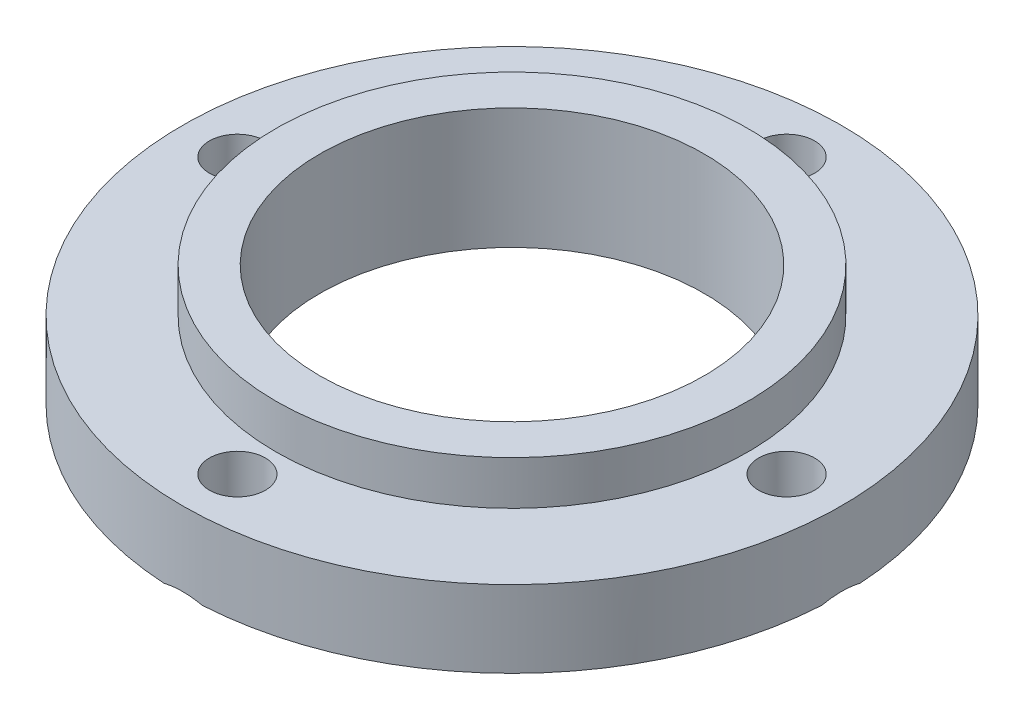
ISO-10303-21;
HEADER;
FILE_DESCRIPTION(('STEP AP214'),'2;1');
FILE_NAME('part.step','',(''),(''),'','','');
FILE_SCHEMA(('AUTOMOTIVE_DESIGN { 1 0 10303 214 1 1 1 1 }'));
ENDSEC;
DATA;
#1=APPLICATION_CONTEXT('core data for automotive mechanical design processes');
#2=APPLICATION_PROTOCOL_DEFINITION('international standard','automotive_design',2000,#1);
#3=PRODUCT_CONTEXT('',#1,'mechanical');
#4=PRODUCT('Part','Part','',(#3));
#5=PRODUCT_RELATED_PRODUCT_CATEGORY('part','',(#4));
#6=PRODUCT_DEFINITION_FORMATION('','',#4);
#7=PRODUCT_DEFINITION_CONTEXT('part definition',#1,'design');
#8=PRODUCT_DEFINITION('design','',#6,#7);
#9=PRODUCT_DEFINITION_SHAPE('','',#8);
#10=(LENGTH_UNIT() NAMED_UNIT(*) SI_UNIT(.MILLI.,.METRE.));
#11=(NAMED_UNIT(*) PLANE_ANGLE_UNIT() SI_UNIT($,.RADIAN.));
#12=(NAMED_UNIT(*) SI_UNIT($,.STERADIAN.) SOLID_ANGLE_UNIT());
#13=UNCERTAINTY_MEASURE_WITH_UNIT(LENGTH_MEASURE(1.E-05),#10,'distance_accuracy_value','');
#14=(GEOMETRIC_REPRESENTATION_CONTEXT(3) GLOBAL_UNCERTAINTY_ASSIGNED_CONTEXT((#13)) GLOBAL_UNIT_ASSIGNED_CONTEXT((#10,
#11,#12)) REPRESENTATION_CONTEXT('',''));
#15=CARTESIAN_POINT('',(0.,0.,0.));
#16=DIRECTION('',(0.,0.,1.));
#17=DIRECTION('',(1.,0.,0.));
#18=AXIS2_PLACEMENT_3D('',#15,#16,#17);
#19=CARTESIAN_POINT('',(0.,7.,0.));
#20=DIRECTION('',(0.,1.,0.));
#21=DIRECTION('',(0.,0.,1.));
#22=AXIS2_PLACEMENT_3D('',#19,#20,#21);
#23=PLANE('',#22);
#24=CARTESIAN_POINT('',(2.61861252083204E-13,7.,25.));
#25=DIRECTION('',(0.,1.,0.));
#26=DIRECTION('',(0.,0.,1.));
#27=AXIS2_PLACEMENT_3D('',#24,#25,#26);
#28=CIRCLE('',#27,2.55);
#29=CARTESIAN_POINT('',(2.61861252083204E-13,7.,27.55));
#30=VERTEX_POINT('',#29);
#31=EDGE_CURVE('E186',#30,#30,#28,.T.);
#32=ORIENTED_EDGE('',*,*,#31,.F.);
#33=EDGE_LOOP('',(#32));
#34=FACE_BOUND('',#33,.T.);
#35=CARTESIAN_POINT('',(-25.,7.,0.));
#36=DIRECTION('',(0.,1.,0.));
#37=DIRECTION('',(0.,0.,1.));
#38=AXIS2_PLACEMENT_3D('',#35,#36,#37);
#39=CIRCLE('',#38,2.55);
#40=CARTESIAN_POINT('',(-25.,7.,2.55));
#41=VERTEX_POINT('',#40);
#42=EDGE_CURVE('E184',#41,#41,#39,.T.);
#43=ORIENTED_EDGE('',*,*,#42,.F.);
#44=EDGE_LOOP('',(#43));
#45=FACE_BOUND('',#44,.T.);
#46=CARTESIAN_POINT('',(0.,7.,-25.));
#47=DIRECTION('',(0.,1.,0.));
#48=DIRECTION('',(0.,0.,1.));
#49=AXIS2_PLACEMENT_3D('',#46,#47,#48);
#50=CIRCLE('',#49,2.55);
#51=CARTESIAN_POINT('',(0.,7.,-22.45));
#52=VERTEX_POINT('',#51);
#53=EDGE_CURVE('E185',#52,#52,#50,.T.);
#54=ORIENTED_EDGE('',*,*,#53,.F.);
#55=EDGE_LOOP('',(#54));
#56=FACE_BOUND('',#55,.T.);
#57=CARTESIAN_POINT('',(25.,7.,0.));
#58=DIRECTION('',(0.,1.,0.));
#59=DIRECTION('',(0.,0.,1.));
#60=AXIS2_PLACEMENT_3D('',#57,#58,#59);
#61=CIRCLE('',#60,2.55);
#62=CARTESIAN_POINT('',(25.,7.,2.55));
#63=VERTEX_POINT('',#62);
#64=EDGE_CURVE('E189',#63,#63,#61,.T.);
#65=ORIENTED_EDGE('',*,*,#64,.F.);
#66=EDGE_LOOP('',(#65));
#67=FACE_BOUND('',#66,.T.);
#68=CARTESIAN_POINT('',(0.,7.,0.));
#69=DIRECTION('',(0.,1.,0.));
#70=DIRECTION('',(0.,0.,1.));
#71=AXIS2_PLACEMENT_3D('',#68,#69,#70);
#72=CIRCLE('',#71,30.);
#73=CARTESIAN_POINT('',(0.,7.,30.));
#74=VERTEX_POINT('',#73);
#75=EDGE_CURVE('E97',#74,#74,#72,.T.);
#76=ORIENTED_EDGE('',*,*,#75,.T.);
#77=EDGE_LOOP('',(#76));
#78=FACE_BOUND('',#77,.T.);
#79=CARTESIAN_POINT('',(0.,7.,0.));
#80=DIRECTION('',(0.,1.,0.));
#81=DIRECTION('',(0.,0.,1.));
#82=AXIS2_PLACEMENT_3D('',#79,#80,#81);
#83=CIRCLE('',#82,21.5);
#84=CARTESIAN_POINT('',(0.,7.,21.5));
#85=VERTEX_POINT('',#84);
#86=EDGE_CURVE('E199',#85,#85,#83,.T.);
#87=ORIENTED_EDGE('',*,*,#86,.F.);
#88=EDGE_LOOP('',(#87));
#89=FACE_BOUND('',#88,.T.);
#90=ADVANCED_FACE('F32',(#34,#45,#56,#67,#78,#89),#23,.T.);
#91=CARTESIAN_POINT('',(0.,0.,0.));
#92=DIRECTION('',(0.,1.,0.));
#93=DIRECTION('',(0.,0.,1.));
#94=AXIS2_PLACEMENT_3D('',#91,#92,#93);
#95=PLANE('',#94);
#96=CARTESIAN_POINT('',(0.,0.,0.));
#97=DIRECTION('',(0.,1.,0.));
#98=DIRECTION('',(0.,0.,1.));
#99=AXIS2_PLACEMENT_3D('',#96,#97,#98);
#100=CIRCLE('',#99,30.);
#101=CARTESIAN_POINT('',(1.75281871210389,0.,29.94875));
#102=VERTEX_POINT('',#101);
#103=CARTESIAN_POINT('',(29.94875,0.,1.75281871210352));
#104=VERTEX_POINT('',#103);
#105=EDGE_CURVE('E72',#102,#104,#100,.T.);
#106=ORIENTED_EDGE('',*,*,#105,.F.);
#107=CARTESIAN_POINT('',(2.61861252083204E-13,0.,25.));
#108=DIRECTION('',(0.,1.,0.));
#109=DIRECTION('',(0.,0.,1.));
#110=AXIS2_PLACEMENT_3D('',#107,#108,#109);
#111=CIRCLE('',#110,5.25000000000003);
#112=CARTESIAN_POINT('',(-1.75281871210326,0.,29.94875));
#113=VERTEX_POINT('',#112);
#114=EDGE_CURVE('E45',#102,#113,#111,.T.);
#115=ORIENTED_EDGE('',*,*,#114,.T.);
#116=CARTESIAN_POINT('',(-29.94875,0.,1.75281871210358));
#117=VERTEX_POINT('',#116);
#118=EDGE_CURVE('E80',#117,#113,#100,.T.);
#119=ORIENTED_EDGE('',*,*,#118,.F.);
#120=CARTESIAN_POINT('',(-25.,0.,0.));
#121=DIRECTION('',(0.,1.,0.));
#122=DIRECTION('',(0.,0.,1.));
#123=AXIS2_PLACEMENT_3D('',#120,#121,#122);
#124=CIRCLE('',#123,5.25000000000003);
#125=CARTESIAN_POINT('',(-29.94875,0.,-1.75281871210358));
#126=VERTEX_POINT('',#125);
#127=EDGE_CURVE('E130',#117,#126,#124,.T.);
#128=ORIENTED_EDGE('',*,*,#127,.T.);
#129=CARTESIAN_POINT('',(-1.75281871210356,0.,-29.94875));
#130=VERTEX_POINT('',#129);
#131=EDGE_CURVE('E208',#130,#126,#100,.T.);
#132=ORIENTED_EDGE('',*,*,#131,.F.);
#133=CARTESIAN_POINT('',(0.,0.,-25.));
#134=DIRECTION('',(0.,1.,0.));
#135=DIRECTION('',(0.,0.,1.));
#136=AXIS2_PLACEMENT_3D('',#133,#134,#135);
#137=CIRCLE('',#136,5.24999999999999);
#138=CARTESIAN_POINT('',(1.75281871210335,0.,-29.94875));
#139=VERTEX_POINT('',#138);
#140=EDGE_CURVE('E215',#130,#139,#137,.T.);
#141=ORIENTED_EDGE('',*,*,#140,.T.);
#142=CARTESIAN_POINT('',(29.94875,0.,-1.75281871210352));
#143=VERTEX_POINT('',#142);
#144=EDGE_CURVE('E83',#143,#139,#100,.T.);
#145=ORIENTED_EDGE('',*,*,#144,.F.);
#146=CARTESIAN_POINT('',(25.,0.,0.));
#147=DIRECTION('',(0.,1.,0.));
#148=DIRECTION('',(0.,0.,1.));
#149=AXIS2_PLACEMENT_3D('',#146,#147,#148);
#150=CIRCLE('',#149,5.25000000000001);
#151=EDGE_CURVE('E88',#143,#104,#150,.T.);
#152=ORIENTED_EDGE('',*,*,#151,.T.);
#153=EDGE_LOOP('',(#106,#115,#119,#128,#132,#141,#145,#152));
#154=FACE_BOUND('',#153,.T.);
#155=CARTESIAN_POINT('',(0.,0.,0.));
#156=DIRECTION('',(0.,1.,0.));
#157=DIRECTION('',(0.,0.,1.));
#158=AXIS2_PLACEMENT_3D('',#155,#156,#157);
#159=CIRCLE('',#158,17.5);
#160=CARTESIAN_POINT('',(0.,0.,17.5));
#161=VERTEX_POINT('',#160);
#162=EDGE_CURVE('E81',#161,#161,#159,.T.);
#163=ORIENTED_EDGE('',*,*,#162,.T.);
#164=EDGE_LOOP('',(#163));
#165=FACE_BOUND('',#164,.T.);
#166=ADVANCED_FACE('F91',(#154,#165),#95,.F.);
#167=CARTESIAN_POINT('',(0.,7.,0.));
#168=DIRECTION('',(0.,-1.,0.));
#169=DIRECTION('',(0.,0.,-1.));
#170=AXIS2_PLACEMENT_3D('',#167,#168,#169);
#171=CYLINDRICAL_SURFACE('',#170,30.);
#172=ORIENTED_EDGE('',*,*,#75,.F.);
#173=EDGE_LOOP('',(#172));
#174=FACE_BOUND('',#173,.T.);
#175=ORIENTED_EDGE('',*,*,#118,.T.);
#176=CARTESIAN_POINT('',(-1.75281871210326,0.,29.94875));
#177=CARTESIAN_POINT('',(-1.66402395755493,0.0247476853704177,29.9539469189763));
#178=CARTESIAN_POINT('',(-1.57476979400035,0.0479095181888161,29.9587743067343));
#179=CARTESIAN_POINT('',(-1.39538358195133,0.0908155371774113,29.9676655084812));
#180=CARTESIAN_POINT('',(-1.30525131629291,0.110558854020147,29.9717291282667));
#181=CARTESIAN_POINT('',(-1.03351731359526,0.16430375875685,29.982739920413));
#182=CARTESIAN_POINT('',(-0.850725271461248,0.192778579600101,29.9884983539558));
#183=CARTESIAN_POINT('',(-0.487832412269876,0.232833965790769,29.9965688203758));
#184=CARTESIAN_POINT('',(-0.307777951458449,0.244817627545143,29.998963115517));
#185=CARTESIAN_POINT('',(0.0525808181106384,0.252469165669916,30.0004941693813));
#186=CARTESIAN_POINT('',(0.232884817951963,0.248149898535128,29.9996334949733));
#187=CARTESIAN_POINT('',(0.525086507120491,0.228123399225332,29.9956159527418));
#188=CARTESIAN_POINT('',(0.637359641360199,0.217276856005545,29.993437731739));
#189=CARTESIAN_POINT('',(0.861147139955751,0.189578901099048,29.9878466611879));
#190=CARTESIAN_POINT('',(0.972661431566672,0.17272692175251,29.9844336949255));
#191=CARTESIAN_POINT('',(1.19638823882946,0.133062642734166,29.9763470421685));
#192=CARTESIAN_POINT('',(1.30858394113001,0.110160363746663,29.971654285507));
#193=CARTESIAN_POINT('',(1.5317056020793,0.0589890248295926,29.9610809709122));
#194=CARTESIAN_POINT('',(1.64263140887656,0.0307193300381594,29.9552002724629));
#195=CARTESIAN_POINT('',(1.75281871210389,0.,29.94875));
#196=B_SPLINE_CURVE_WITH_KNOTS('',3,(#176,#177,#178,#179,#180,#181,#182,#183,#184,#185,#186,
#187,#188,#189,#190,#191,#192,#193,#194,#195),.UNSPECIFIED.,.F.,.F.,(4,2,2,2,2,2,2,2,2,4),(0.,
0.276947357386364,0.553965039285316,1.10845792811522,1.64914093011424,2.18939763844636,
2.52769338640184,2.86602112002194,3.20969525354794,3.55341006245429),.UNSPECIFIED.);
#197=EDGE_CURVE('E11',#113,#102,#196,.T.);
#198=ORIENTED_EDGE('',*,*,#197,.T.);
#199=ORIENTED_EDGE('',*,*,#105,.T.);
#200=CARTESIAN_POINT('',(29.94875,0.,1.75281871210352));
#201=CARTESIAN_POINT('',(29.9539469189763,0.0247476853704178,1.66402395755518));
#202=CARTESIAN_POINT('',(29.9587743067343,0.0479095181888137,1.5747697940006));
#203=CARTESIAN_POINT('',(29.9676655084812,0.0908155371774029,1.39538358195158));
#204=CARTESIAN_POINT('',(29.9717291282667,0.110558854020135,1.30525131629316));
#205=CARTESIAN_POINT('',(29.982739920413,0.164303758756832,1.03351731359552));
#206=CARTESIAN_POINT('',(29.9884983539558,0.192778579600087,0.85072527146151));
#207=CARTESIAN_POINT('',(29.9965688203758,0.232833965790756,0.487832412270142));
#208=CARTESIAN_POINT('',(29.998963115517,0.244817627545127,0.307777951458717));
#209=CARTESIAN_POINT('',(30.0004941693813,0.252469165669896,-0.0525808181103661));
#210=CARTESIAN_POINT('',(29.9996334949733,0.248149898535106,-0.232884817951688));
#211=CARTESIAN_POINT('',(29.9956159527418,0.228123399225309,-0.525086507120206));
#212=CARTESIAN_POINT('',(29.993437731739,0.217276856005522,-0.637359641359906));
#213=CARTESIAN_POINT('',(29.9878466611879,0.189578901099028,-0.861147139955441));
#214=CARTESIAN_POINT('',(29.9844336949255,0.172726921752491,-0.972661431566354));
#215=CARTESIAN_POINT('',(29.9763470421685,0.13306264273415,-1.19638823882913));
#216=CARTESIAN_POINT('',(29.971654285507,0.110160363746647,-1.30858394112966));
#217=CARTESIAN_POINT('',(29.9610809709122,0.0589890248295809,-1.53170560207894));
#218=CARTESIAN_POINT('',(29.9552002724629,0.0307193300381509,-1.6426314088762));
#219=CARTESIAN_POINT('',(29.94875,0.,-1.75281871210352));
#220=B_SPLINE_CURVE_WITH_KNOTS('',3,(#200,#201,#202,#203,#204,#205,#206,#207,#208,#209,#210,
#211,#212,#213,#214,#215,#216,#217,#218,#219),.UNSPECIFIED.,.F.,.F.,(4,2,2,2,2,2,2,2,2,4),(0.,
0.27694735738636,0.553965039285308,1.10845792811521,1.64914093011422,2.18939763844633,
2.52769338640178,2.86602112002186,3.20969525354783,3.55341006245416),.UNSPECIFIED.);
#221=EDGE_CURVE('E76',#104,#143,#220,.T.);
#222=ORIENTED_EDGE('',*,*,#221,.T.);
#223=ORIENTED_EDGE('',*,*,#144,.T.);
#224=CARTESIAN_POINT('',(1.75281871210335,0.,-29.94875));
#225=CARTESIAN_POINT('',(1.66402395755501,0.0247476853704115,-29.9539469189763));
#226=CARTESIAN_POINT('',(1.57476979400044,0.0479095181888057,-29.9587743067343));
#227=CARTESIAN_POINT('',(1.39538358195142,0.0908155371773948,-29.9676655084812));
#228=CARTESIAN_POINT('',(1.305251316293,0.110558854020129,-29.9717291282667));
#229=CARTESIAN_POINT('',(1.03351731359536,0.164303758756827,-29.982739920413));
#230=CARTESIAN_POINT('',(0.850725271461353,0.192778579600076,-29.9884983539558));
#231=CARTESIAN_POINT('',(0.487832412269989,0.232833965790737,-29.9965688203758));
#232=CARTESIAN_POINT('',(0.307777951458566,0.244817627545106,-29.998963115517));
#233=CARTESIAN_POINT('',(-0.0525808181105127,0.252469165669874,-30.0004941693813));
#234=CARTESIAN_POINT('',(-0.232884817951832,0.248149898535086,-29.9996334949733));
#235=CARTESIAN_POINT('',(-0.52508650712034,0.228123399225288,-29.9956159527418));
#236=CARTESIAN_POINT('',(-0.637359641360031,0.217276856005501,-29.993437731739));
#237=CARTESIAN_POINT('',(-0.861147139955551,0.189578901099007,-29.9878466611879));
#238=CARTESIAN_POINT('',(-0.972661431566455,0.172726921752471,-29.9844336949255));
#239=CARTESIAN_POINT('',(-1.19638823882921,0.133062642734134,-29.9763470421685));
#240=CARTESIAN_POINT('',(-1.30858394112974,0.110160363746634,-29.971654285507));
#241=CARTESIAN_POINT('',(-1.531705602079,0.0589890248295722,-29.9610809709122));
#242=CARTESIAN_POINT('',(-1.64263140887625,0.0307193300381441,-29.9552002724629));
#243=CARTESIAN_POINT('',(-1.75281871210356,0.,-29.94875));
#244=B_SPLINE_CURVE_WITH_KNOTS('',3,(#224,#225,#226,#227,#228,#229,#230,#231,#232,#233,#234,
#235,#236,#237,#238,#239,#240,#241,#242,#243),.UNSPECIFIED.,.F.,.F.,(4,2,2,2,2,2,2,2,2,4),(0.,
0.276947357386357,0.553965039285301,1.10845792811519,1.64914093011419,2.1893976384463,
2.52769338640173,2.86602112002178,3.20969525354773,3.55341006245403),.UNSPECIFIED.);
#245=EDGE_CURVE('E117',#139,#130,#244,.T.);
#246=ORIENTED_EDGE('',*,*,#245,.T.);
#247=ORIENTED_EDGE('',*,*,#131,.T.);
#248=CARTESIAN_POINT('',(-29.94875,0.,-1.75281871210358));
#249=CARTESIAN_POINT('',(-29.9539469189763,0.024747685370421,-1.66402395755524));
#250=CARTESIAN_POINT('',(-29.9587743067342,0.0479095181888193,-1.57476979400066));
#251=CARTESIAN_POINT('',(-29.9676655084812,0.0908155371774119,-1.39538358195164));
#252=CARTESIAN_POINT('',(-29.9717291282667,0.110558854020146,-1.30525131629322));
#253=CARTESIAN_POINT('',(-29.982739920413,0.164303758756845,-1.03351731359558));
#254=CARTESIAN_POINT('',(-29.9884983539558,0.192778579600099,-0.850725271461562));
#255=CARTESIAN_POINT('',(-29.9965688203758,0.232833965790771,-0.487832412270189));
#256=CARTESIAN_POINT('',(-29.998963115517,0.244817627545144,-0.307777951458762));
#257=CARTESIAN_POINT('',(-30.0004941693813,0.252469165669917,0.0525808181103249));
#258=CARTESIAN_POINT('',(-29.9996334949733,0.248149898535129,0.232884817951649));
#259=CARTESIAN_POINT('',(-29.9956159527418,0.228123399225332,0.525086507120178));
#260=CARTESIAN_POINT('',(-29.993437731739,0.217276856005545,0.637359641359886));
#261=CARTESIAN_POINT('',(-29.9878466611879,0.189578901099049,0.861147139955438));
#262=CARTESIAN_POINT('',(-29.9844336949255,0.172726921752511,0.972661431566359));
#263=CARTESIAN_POINT('',(-29.9763470421685,0.133062642734166,1.19638823882915));
#264=CARTESIAN_POINT('',(-29.971654285507,0.110160363746661,1.30858394112969));
#265=CARTESIAN_POINT('',(-29.9610809709122,0.0589890248295898,1.53170560207899));
#266=CARTESIAN_POINT('',(-29.9552002724629,0.0307193300381569,1.64263140887625));
#267=CARTESIAN_POINT('',(-29.94875,0.,1.75281871210358));
#268=B_SPLINE_CURVE_WITH_KNOTS('',3,(#248,#249,#250,#251,#252,#253,#254,#255,#256,#257,#258,
#259,#260,#261,#262,#263,#264,#265,#266,#267),.UNSPECIFIED.,.F.,.F.,(4,2,2,2,2,2,2,2,2,4),(0.,
0.276947357386364,0.553965039285315,1.10845792811522,1.64914093011424,2.18939763844636,
2.52769338640184,2.86602112002194,3.20969525354794,3.55341006245429),.UNSPECIFIED.);
#269=EDGE_CURVE('E123',#126,#117,#268,.T.);
#270=ORIENTED_EDGE('',*,*,#269,.T.);
#271=EDGE_LOOP('',(#175,#198,#199,#222,#223,#246,#247,#270));
#272=FACE_BOUND('',#271,.T.);
#273=ADVANCED_FACE('F74',(#174,#272),#171,.T.);
#274=CARTESIAN_POINT('',(0.,7.,0.));
#275=DIRECTION('',(0.,-1.,0.));
#276=DIRECTION('',(0.,0.,-1.));
#277=AXIS2_PLACEMENT_3D('',#274,#275,#276);
#278=CYLINDRICAL_SURFACE('',#277,17.5);
#279=ORIENTED_EDGE('',*,*,#162,.F.);
#280=EDGE_LOOP('',(#279));
#281=FACE_BOUND('',#280,.T.);
#282=CARTESIAN_POINT('',(0.,11.,0.));
#283=DIRECTION('',(0.,1.,0.));
#284=DIRECTION('',(0.,0.,1.));
#285=AXIS2_PLACEMENT_3D('',#282,#283,#284);
#286=CIRCLE('',#285,17.5);
#287=CARTESIAN_POINT('',(0.,11.,17.5));
#288=VERTEX_POINT('',#287);
#289=EDGE_CURVE('E196',#288,#288,#286,.T.);
#290=ORIENTED_EDGE('',*,*,#289,.T.);
#291=EDGE_LOOP('',(#290));
#292=FACE_BOUND('',#291,.T.);
#293=ADVANCED_FACE('F110',(#281,#292),#278,.F.);
#294=CARTESIAN_POINT('',(0.,11.,0.));
#295=DIRECTION('',(0.,1.,0.));
#296=DIRECTION('',(0.,0.,1.));
#297=AXIS2_PLACEMENT_3D('',#294,#295,#296);
#298=PLANE('',#297);
#299=CARTESIAN_POINT('',(0.,11.,0.));
#300=DIRECTION('',(0.,1.,0.));
#301=DIRECTION('',(0.,0.,1.));
#302=AXIS2_PLACEMENT_3D('',#299,#300,#301);
#303=CIRCLE('',#302,21.5);
#304=CARTESIAN_POINT('',(0.,11.,21.5));
#305=VERTEX_POINT('',#304);
#306=EDGE_CURVE('E200',#305,#305,#303,.T.);
#307=ORIENTED_EDGE('',*,*,#306,.T.);
#308=EDGE_LOOP('',(#307));
#309=FACE_BOUND('',#308,.T.);
#310=ORIENTED_EDGE('',*,*,#289,.F.);
#311=EDGE_LOOP('',(#310));
#312=FACE_BOUND('',#311,.T.);
#313=ADVANCED_FACE('F157',(#309,#312),#298,.T.);
#314=CARTESIAN_POINT('',(0.,11.,0.));
#315=DIRECTION('',(0.,-1.,0.));
#316=DIRECTION('',(0.,0.,-1.));
#317=AXIS2_PLACEMENT_3D('',#314,#315,#316);
#318=CYLINDRICAL_SURFACE('',#317,21.5);
#319=ORIENTED_EDGE('',*,*,#306,.F.);
#320=EDGE_LOOP('',(#319));
#321=FACE_BOUND('',#320,.T.);
#322=ORIENTED_EDGE('',*,*,#86,.T.);
#323=EDGE_LOOP('',(#322));
#324=FACE_BOUND('',#323,.T.);
#325=ADVANCED_FACE('F159',(#321,#324),#318,.T.);
#326=CARTESIAN_POINT('',(25.,11.,0.));
#327=DIRECTION('',(0.,-1.,0.));
#328=DIRECTION('',(0.,0.,-1.));
#329=AXIS2_PLACEMENT_3D('',#326,#327,#328);
#330=CYLINDRICAL_SURFACE('',#329,2.55);
#331=CARTESIAN_POINT('',(25.,2.7,0.));
#332=DIRECTION('',(0.,1.,0.));
#333=DIRECTION('',(0.,0.,1.));
#334=AXIS2_PLACEMENT_3D('',#331,#332,#333);
#335=CIRCLE('',#334,2.55);
#336=CARTESIAN_POINT('',(25.,2.7,2.55));
#337=VERTEX_POINT('',#336);
#338=EDGE_CURVE('E94',#337,#337,#335,.F.);
#339=ORIENTED_EDGE('',*,*,#338,.T.);
#340=EDGE_LOOP('',(#339));
#341=FACE_BOUND('',#340,.T.);
#342=ORIENTED_EDGE('',*,*,#64,.T.);
#343=EDGE_LOOP('',(#342));
#344=FACE_BOUND('',#343,.T.);
#345=ADVANCED_FACE('F162',(#341,#344),#330,.F.);
#346=CARTESIAN_POINT('',(25.,2.7,0.));
#347=DIRECTION('',(0.,-1.,0.));
#348=DIRECTION('',(0.,0.,-1.));
#349=AXIS2_PLACEMENT_3D('',#346,#347,#348);
#350=CONICAL_SURFACE('',#349,2.55,0.785398163397451);
#351=ORIENTED_EDGE('',*,*,#221,.F.);
#352=ORIENTED_EDGE('',*,*,#151,.F.);
#353=EDGE_LOOP('',(#351,#352));
#354=FACE_BOUND('',#353,.T.);
#355=ORIENTED_EDGE('',*,*,#338,.F.);
#356=EDGE_LOOP('',(#355));
#357=FACE_BOUND('',#356,.T.);
#358=ADVANCED_FACE('F86',(#354,#357),#350,.F.);
#359=CARTESIAN_POINT('',(0.,11.,-25.));
#360=DIRECTION('',(0.,-1.,0.));
#361=DIRECTION('',(0.,0.,-1.));
#362=AXIS2_PLACEMENT_3D('',#359,#360,#361);
#363=CYLINDRICAL_SURFACE('',#362,2.55);
#364=CARTESIAN_POINT('',(0.,2.69999999999999,-25.));
#365=DIRECTION('',(0.,1.,0.));
#366=DIRECTION('',(0.,0.,1.));
#367=AXIS2_PLACEMENT_3D('',#364,#365,#366);
#368=CIRCLE('',#367,2.55);
#369=CARTESIAN_POINT('',(0.,2.69999999999999,-22.45));
#370=VERTEX_POINT('',#369);
#371=EDGE_CURVE('E89',#370,#370,#368,.F.);
#372=ORIENTED_EDGE('',*,*,#371,.T.);
#373=EDGE_LOOP('',(#372));
#374=FACE_BOUND('',#373,.T.);
#375=ORIENTED_EDGE('',*,*,#53,.T.);
#376=EDGE_LOOP('',(#375));
#377=FACE_BOUND('',#376,.T.);
#378=ADVANCED_FACE('F170',(#374,#377),#363,.F.);
#379=CARTESIAN_POINT('',(-25.,11.,0.));
#380=DIRECTION('',(0.,-1.,0.));
#381=DIRECTION('',(0.,0.,-1.));
#382=AXIS2_PLACEMENT_3D('',#379,#380,#381);
#383=CYLINDRICAL_SURFACE('',#382,2.55);
#384=CARTESIAN_POINT('',(-25.,2.70000000000001,0.));
#385=DIRECTION('',(0.,1.,0.));
#386=DIRECTION('',(0.,0.,1.));
#387=AXIS2_PLACEMENT_3D('',#384,#385,#386);
#388=CIRCLE('',#387,2.55);
#389=CARTESIAN_POINT('',(-25.,2.70000000000001,2.55));
#390=VERTEX_POINT('',#389);
#391=EDGE_CURVE('E181',#390,#390,#388,.F.);
#392=ORIENTED_EDGE('',*,*,#391,.T.);
#393=EDGE_LOOP('',(#392));
#394=FACE_BOUND('',#393,.T.);
#395=ORIENTED_EDGE('',*,*,#42,.T.);
#396=EDGE_LOOP('',(#395));
#397=FACE_BOUND('',#396,.T.);
#398=ADVANCED_FACE('F143',(#394,#397),#383,.F.);
#399=CARTESIAN_POINT('',(2.61861252083204E-13,11.,25.));
#400=DIRECTION('',(0.,-1.,0.));
#401=DIRECTION('',(0.,0.,-1.));
#402=AXIS2_PLACEMENT_3D('',#399,#400,#401);
#403=CYLINDRICAL_SURFACE('',#402,2.55);
#404=CARTESIAN_POINT('',(2.61861252083204E-13,2.70000000000001,25.));
#405=DIRECTION('',(0.,1.,0.));
#406=DIRECTION('',(0.,0.,1.));
#407=AXIS2_PLACEMENT_3D('',#404,#405,#406);
#408=CIRCLE('',#407,2.55);
#409=CARTESIAN_POINT('',(2.61861252083204E-13,2.70000000000001,27.55));
#410=VERTEX_POINT('',#409);
#411=EDGE_CURVE('E129',#410,#410,#408,.F.);
#412=ORIENTED_EDGE('',*,*,#411,.T.);
#413=EDGE_LOOP('',(#412));
#414=FACE_BOUND('',#413,.T.);
#415=ORIENTED_EDGE('',*,*,#31,.T.);
#416=EDGE_LOOP('',(#415));
#417=FACE_BOUND('',#416,.T.);
#418=ADVANCED_FACE('F138',(#414,#417),#403,.F.);
#419=CARTESIAN_POINT('',(0.,2.69999999999999,-25.));
#420=DIRECTION('',(0.,-1.,0.));
#421=DIRECTION('',(0.,0.,-1.));
#422=AXIS2_PLACEMENT_3D('',#419,#420,#421);
#423=CONICAL_SURFACE('',#422,2.55,0.785398163397449);
#424=ORIENTED_EDGE('',*,*,#245,.F.);
#425=ORIENTED_EDGE('',*,*,#140,.F.);
#426=EDGE_LOOP('',(#424,#425));
#427=FACE_BOUND('',#426,.T.);
#428=ORIENTED_EDGE('',*,*,#371,.F.);
#429=EDGE_LOOP('',(#428));
#430=FACE_BOUND('',#429,.T.);
#431=ADVANCED_FACE('F134',(#427,#430),#423,.F.);
#432=CARTESIAN_POINT('',(-25.,2.70000000000001,0.));
#433=DIRECTION('',(0.,-1.,0.));
#434=DIRECTION('',(0.,0.,-1.));
#435=AXIS2_PLACEMENT_3D('',#432,#433,#434);
#436=CONICAL_SURFACE('',#435,2.55,0.785398163397452);
#437=ORIENTED_EDGE('',*,*,#269,.F.);
#438=ORIENTED_EDGE('',*,*,#127,.F.);
#439=EDGE_LOOP('',(#437,#438));
#440=FACE_BOUND('',#439,.T.);
#441=ORIENTED_EDGE('',*,*,#391,.F.);
#442=EDGE_LOOP('',(#441));
#443=FACE_BOUND('',#442,.T.);
#444=ADVANCED_FACE('F131',(#440,#443),#436,.F.);
#445=CARTESIAN_POINT('',(2.61861252083204E-13,2.70000000000001,25.));
#446=DIRECTION('',(0.,-1.,0.));
#447=DIRECTION('',(0.,0.,-1.));
#448=AXIS2_PLACEMENT_3D('',#445,#446,#447);
#449=CONICAL_SURFACE('',#448,2.55,0.785398163397452);
#450=ORIENTED_EDGE('',*,*,#197,.F.);
#451=ORIENTED_EDGE('',*,*,#114,.F.);
#452=EDGE_LOOP('',(#450,#451));
#453=FACE_BOUND('',#452,.T.);
#454=ORIENTED_EDGE('',*,*,#411,.F.);
#455=EDGE_LOOP('',(#454));
#456=FACE_BOUND('',#455,.T.);
#457=ADVANCED_FACE('F34',(#453,#456),#449,.F.);
#458=CLOSED_SHELL('',(#90,#166,#273,#293,#313,#325,#345,#358,#378,#398,#418,#431,#444,#457));
#459=MANIFOLD_SOLID_BREP('B2',#458);
#460=ADVANCED_BREP_SHAPE_REPRESENTATION('',(#18,#459),#14);
#461=SHAPE_DEFINITION_REPRESENTATION(#9,#460);
ENDSEC;
END-ISO-10303-21;
